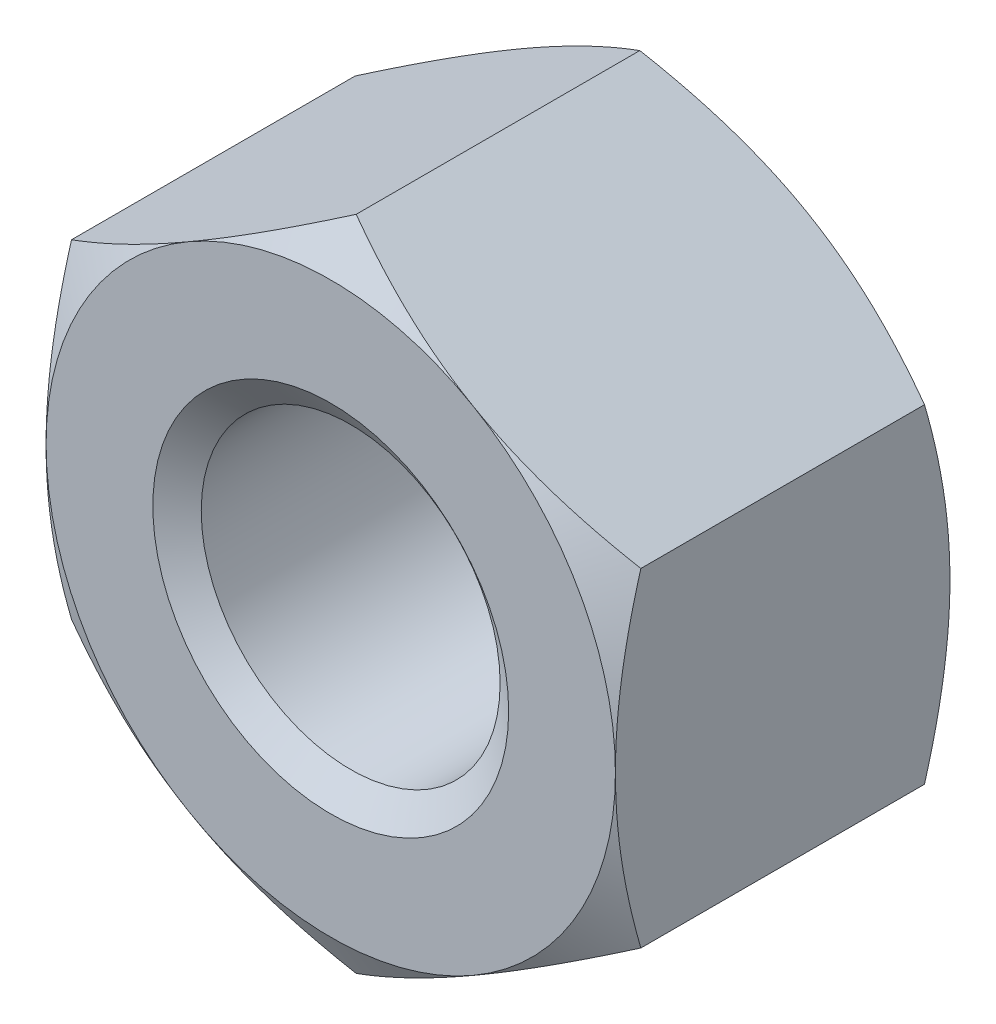
ISO-10303-21;
HEADER;
FILE_DESCRIPTION(('STEP AP214'),'2;1');
FILE_NAME('part.step','',(''),(''),'','','');
FILE_SCHEMA(('AUTOMOTIVE_DESIGN { 1 0 10303 214 1 1 1 1 }'));
ENDSEC;
DATA;
#1=APPLICATION_CONTEXT('core data for automotive mechanical design processes');
#2=APPLICATION_PROTOCOL_DEFINITION('international standard','automotive_design',2000,#1);
#3=PRODUCT_CONTEXT('',#1,'mechanical');
#4=PRODUCT('Part','Part','',(#3));
#5=PRODUCT_RELATED_PRODUCT_CATEGORY('part','',(#4));
#6=PRODUCT_DEFINITION_FORMATION('','',#4);
#7=PRODUCT_DEFINITION_CONTEXT('part definition',#1,'design');
#8=PRODUCT_DEFINITION('design','',#6,#7);
#9=PRODUCT_DEFINITION_SHAPE('','',#8);
#10=(LENGTH_UNIT() NAMED_UNIT(*) SI_UNIT(.MILLI.,.METRE.));
#11=(NAMED_UNIT(*) PLANE_ANGLE_UNIT() SI_UNIT($,.RADIAN.));
#12=(NAMED_UNIT(*) SI_UNIT($,.STERADIAN.) SOLID_ANGLE_UNIT());
#13=UNCERTAINTY_MEASURE_WITH_UNIT(LENGTH_MEASURE(1.E-05),#10,'distance_accuracy_value','');
#14=(GEOMETRIC_REPRESENTATION_CONTEXT(3) GLOBAL_UNCERTAINTY_ASSIGNED_CONTEXT((#13)) GLOBAL_UNIT_ASSIGNED_CONTEXT((#10,
#11,#12)) REPRESENTATION_CONTEXT('',''));
#15=CARTESIAN_POINT('',(0.,0.,0.));
#16=DIRECTION('',(0.,0.,1.));
#17=DIRECTION('',(1.,0.,0.));
#18=AXIS2_PLACEMENT_3D('',#15,#16,#17);
#19=CARTESIAN_POINT('',(0.,0.,-4.7));
#20=DIRECTION('',(0.,0.,1.));
#21=DIRECTION('',(1.,0.,0.));
#22=AXIS2_PLACEMENT_3D('',#19,#20,#21);
#23=CYLINDRICAL_SURFACE('',#22,2.1);
#24=CARTESIAN_POINT('',(0.,0.,-0.28008301528388));
#25=DIRECTION('',(0.,0.,1.));
#26=DIRECTION('',(1.,0.,0.));
#27=AXIS2_PLACEMENT_3D('',#24,#25,#26);
#28=CIRCLE('',#27,2.1);
#29=CARTESIAN_POINT('',(2.1,0.,-0.28008301528388));
#30=VERTEX_POINT('',#29);
#31=EDGE_CURVE('E170',#30,#30,#28,.F.);
#32=ORIENTED_EDGE('',*,*,#31,.F.);
#33=EDGE_LOOP('',(#32));
#34=FACE_BOUND('',#33,.T.);
#35=CARTESIAN_POINT('',(0.,0.,-4.39451698471612));
#36=DIRECTION('',(0.,0.,-1.));
#37=DIRECTION('',(-1.,0.,0.));
#38=AXIS2_PLACEMENT_3D('',#35,#36,#37);
#39=CIRCLE('',#38,2.1);
#40=CARTESIAN_POINT('',(-2.1,0.,-4.39451698471612));
#41=VERTEX_POINT('',#40);
#42=EDGE_CURVE('E35',#41,#41,#39,.F.);
#43=ORIENTED_EDGE('',*,*,#42,.F.);
#44=EDGE_LOOP('',(#43));
#45=FACE_BOUND('',#44,.T.);
#46=ADVANCED_FACE('F30',(#34,#45),#23,.F.);
#47=CARTESIAN_POINT('',(0.,4.61880215351702,-4.7));
#48=DIRECTION('',(0.,0.,-1.));
#49=DIRECTION('',(-1.,0.,0.));
#50=AXIS2_PLACEMENT_3D('',#47,#48,#49);
#51=PLANE('',#50);
#52=CARTESIAN_POINT('',(0.,0.,-4.7));
#53=DIRECTION('',(0.,0.,-1.));
#54=DIRECTION('',(-1.,0.,0.));
#55=AXIS2_PLACEMENT_3D('',#52,#53,#54);
#56=CIRCLE('',#55,4.);
#57=CARTESIAN_POINT('',(-4.,0.,-4.7));
#58=VERTEX_POINT('',#57);
#59=CARTESIAN_POINT('',(-2.00000000000002,-3.46410161513774,-4.7));
#60=VERTEX_POINT('',#59);
#61=EDGE_CURVE('E166',#58,#60,#56,.F.);
#62=ORIENTED_EDGE('',*,*,#61,.F.);
#63=CARTESIAN_POINT('',(-2.00000000000001,3.46410161513775,-4.7));
#64=VERTEX_POINT('',#63);
#65=EDGE_CURVE('E148',#64,#58,#56,.F.);
#66=ORIENTED_EDGE('',*,*,#65,.F.);
#67=CARTESIAN_POINT('',(2.00000000000003,3.46410161513774,-4.7));
#68=VERTEX_POINT('',#67);
#69=EDGE_CURVE('E165',#68,#64,#56,.F.);
#70=ORIENTED_EDGE('',*,*,#69,.F.);
#71=CARTESIAN_POINT('',(0.,0.,-4.7));
#72=DIRECTION('',(0.,0.,1.));
#73=DIRECTION('',(1.,0.,0.));
#74=AXIS2_PLACEMENT_3D('',#71,#72,#73);
#75=CIRCLE('',#74,4.);
#76=CARTESIAN_POINT('',(4.,0.,-4.7));
#77=VERTEX_POINT('',#76);
#78=EDGE_CURVE('E240',#77,#68,#75,.T.);
#79=ORIENTED_EDGE('',*,*,#78,.F.);
#80=CARTESIAN_POINT('',(2.00000000000001,-3.46410161513775,-4.7));
#81=VERTEX_POINT('',#80);
#82=EDGE_CURVE('E356',#81,#77,#56,.F.);
#83=ORIENTED_EDGE('',*,*,#82,.F.);
#84=EDGE_CURVE('E360',#60,#81,#56,.F.);
#85=ORIENTED_EDGE('',*,*,#84,.F.);
#86=EDGE_LOOP('',(#62,#66,#70,#79,#83,#85));
#87=FACE_BOUND('',#86,.T.);
#88=CARTESIAN_POINT('',(0.,0.,-4.7));
#89=DIRECTION('',(0.,0.,-1.));
#90=DIRECTION('',(-1.,0.,0.));
#91=AXIS2_PLACEMENT_3D('',#88,#89,#90);
#92=CIRCLE('',#91,2.5);
#93=CARTESIAN_POINT('',(-2.5,0.,-4.7));
#94=VERTEX_POINT('',#93);
#95=EDGE_CURVE('E173',#94,#94,#92,.F.);
#96=ORIENTED_EDGE('',*,*,#95,.T.);
#97=EDGE_LOOP('',(#96));
#98=FACE_BOUND('',#97,.T.);
#99=ADVANCED_FACE('F293',(#87,#98),#51,.T.);
#100=CARTESIAN_POINT('',(0.,4.61880215351702,0.));
#101=DIRECTION('',(0.,0.,-1.));
#102=DIRECTION('',(-1.,0.,0.));
#103=AXIS2_PLACEMENT_3D('',#100,#101,#102);
#104=PLANE('',#103);
#105=CARTESIAN_POINT('',(0.,0.,0.));
#106=DIRECTION('',(0.,0.,-1.));
#107=DIRECTION('',(-1.,0.,0.));
#108=AXIS2_PLACEMENT_3D('',#105,#106,#107);
#109=CIRCLE('',#108,4.);
#110=CARTESIAN_POINT('',(-4.,0.,0.));
#111=VERTEX_POINT('',#110);
#112=CARTESIAN_POINT('',(-2.00000000000001,3.46410161513775,0.));
#113=VERTEX_POINT('',#112);
#114=EDGE_CURVE('E11',#111,#113,#109,.T.);
#115=ORIENTED_EDGE('',*,*,#114,.F.);
#116=CARTESIAN_POINT('',(-2.00000000000002,-3.46410161513774,0.));
#117=VERTEX_POINT('',#116);
#118=EDGE_CURVE('E42',#117,#111,#109,.T.);
#119=ORIENTED_EDGE('',*,*,#118,.F.);
#120=CARTESIAN_POINT('',(2.00000000000001,-3.46410161513775,0.));
#121=VERTEX_POINT('',#120);
#122=EDGE_CURVE('E169',#121,#117,#109,.T.);
#123=ORIENTED_EDGE('',*,*,#122,.F.);
#124=CARTESIAN_POINT('',(4.,0.,0.));
#125=VERTEX_POINT('',#124);
#126=EDGE_CURVE('E347',#125,#121,#109,.T.);
#127=ORIENTED_EDGE('',*,*,#126,.F.);
#128=CARTESIAN_POINT('',(0.,0.,0.));
#129=DIRECTION('',(0.,0.,1.));
#130=DIRECTION('',(1.,0.,0.));
#131=AXIS2_PLACEMENT_3D('',#128,#129,#130);
#132=CIRCLE('',#131,4.);
#133=CARTESIAN_POINT('',(2.00000000000003,3.46410161513774,0.));
#134=VERTEX_POINT('',#133);
#135=EDGE_CURVE('E124',#125,#134,#132,.T.);
#136=ORIENTED_EDGE('',*,*,#135,.T.);
#137=EDGE_CURVE('E40',#113,#134,#109,.T.);
#138=ORIENTED_EDGE('',*,*,#137,.F.);
#139=EDGE_LOOP('',(#115,#119,#123,#127,#136,#138));
#140=FACE_BOUND('',#139,.T.);
#141=CARTESIAN_POINT('',(0.,0.,0.));
#142=DIRECTION('',(0.,0.,1.));
#143=DIRECTION('',(1.,0.,0.));
#144=AXIS2_PLACEMENT_3D('',#141,#142,#143);
#145=CIRCLE('',#144,2.5);
#146=CARTESIAN_POINT('',(2.5,0.,0.));
#147=VERTEX_POINT('',#146);
#148=EDGE_CURVE('E172',#147,#147,#145,.T.);
#149=ORIENTED_EDGE('',*,*,#148,.F.);
#150=EDGE_LOOP('',(#149));
#151=FACE_BOUND('',#150,.T.);
#152=ADVANCED_FACE('F245',(#140,#151),#104,.F.);
#153=CARTESIAN_POINT('',(0.,4.61880215351702,-4.7));
#154=DIRECTION('',(-0.500000000000002,0.866025403784437,0.));
#155=DIRECTION('',(-0.866025403784437,-0.500000000000002,0.));
#156=AXIS2_PLACEMENT_3D('',#153,#154,#155);
#157=PLANE('',#156);
#158=DIRECTION('',(0.,0.,1.));
#159=VECTOR('',#158,1.);
#160=CARTESIAN_POINT('',(-4.,2.3094010767585,-4.7));
#161=LINE('',#160,#159);
#162=CARTESIAN_POINT('',(-4.,2.30940107675853,-4.34273441009183));
#163=VERTEX_POINT('',#162);
#164=CARTESIAN_POINT('',(-4.,2.3094010767585,-0.357265589908163));
#165=VERTEX_POINT('',#164);
#166=EDGE_CURVE('E160',#163,#165,#161,.T.);
#167=ORIENTED_EDGE('',*,*,#166,.T.);
#168=CARTESIAN_POINT('',(-4.0002,2.30928560670466,-0.357332259074767));
#169=CARTESIAN_POINT('',(-3.82442084967677,2.4107717464617,-0.298717873648283));
#170=CARTESIAN_POINT('',(-3.64712438367362,2.51313390883499,-0.245410321462263));
#171=CARTESIAN_POINT('',(-3.28946140682429,2.71963072479811,-0.152361670746403));
#172=CARTESIAN_POINT('',(-3.10908854102985,2.82376904741904,-0.112653489029704));
#173=CARTESIAN_POINT('',(-2.75057818129721,3.03075510011795,-0.0508422152802782));
#174=CARTESIAN_POINT('',(-2.57249584706486,3.13357098372491,-0.0283277315228877));
#175=CARTESIAN_POINT('',(-2.21549328283349,3.33968651028528,-0.00145062314658093));
#176=CARTESIAN_POINT('',(-2.0365743503559,3.44298540411434,0.002934258573057));
#177=CARTESIAN_POINT('',(-1.70225715780327,3.63600352522932,-0.00619007293997066));
#178=CARTESIAN_POINT('',(-1.54680884001293,3.72575165335065,-0.0174589539879948));
#179=CARTESIAN_POINT('',(-1.23692494436494,3.90466320392055,-0.0531739907981949));
#180=CARTESIAN_POINT('',(-1.08249043825587,3.99382600759479,-0.0776323457115357));
#181=CARTESIAN_POINT('',(-0.771967672225416,4.17310641015198,-0.138776064919294));
#182=CARTESIAN_POINT('',(-0.615918711936891,4.26320131938132,-0.175720603654869));
#183=CARTESIAN_POINT('',(-0.306148164596151,4.44204742827552,-0.259570072548035));
#184=CARTESIAN_POINT('',(-0.15242260922621,4.53080091904968,-0.306455302212749));
#185=CARTESIAN_POINT('',(0.000200000000011548,4.61891762357086,-0.357332259074777));
#186=B_SPLINE_CURVE_WITH_KNOTS('',3,(#168,#169,#170,#171,#172,#173,#174,#175,#176,#177,#178,
#179,#180,#181,#182,#183,#184,#185),.UNSPECIFIED.,.F.,.F.,(4,2,2,2,2,2,2,2,4),(0.,
0.634047835695966,1.26961969224543,1.88946157213122,2.50854226669297,3.04757825393386,
3.58711366126905,4.13861653143765,4.68903648037745),.UNSPECIFIED.);
#187=EDGE_CURVE('E129',#165,#113,#186,.T.);
#188=ORIENTED_EDGE('',*,*,#187,.T.);
#189=CARTESIAN_POINT('',(0.,4.61880215351702,-0.357265589908173));
#190=VERTEX_POINT('',#189);
#191=EDGE_CURVE('E49',#113,#190,#186,.T.);
#192=ORIENTED_EDGE('',*,*,#191,.T.);
#193=DIRECTION('',(0.,0.,1.));
#194=VECTOR('',#193,1.);
#195=CARTESIAN_POINT('',(0.,4.61880215351702,-4.7));
#196=LINE('',#195,#194);
#197=CARTESIAN_POINT('',(0.,4.61880215351702,-4.34273441009183));
#198=VERTEX_POINT('',#197);
#199=EDGE_CURVE('E145',#198,#190,#196,.T.);
#200=ORIENTED_EDGE('',*,*,#199,.F.);
#201=CARTESIAN_POINT('',(-4.0002,2.30928560670466,-4.34266774092523));
#202=CARTESIAN_POINT('',(-3.82442084967677,2.4107717464617,-4.40128212635172));
#203=CARTESIAN_POINT('',(-3.64712438367362,2.51313390883499,-4.45458967853774));
#204=CARTESIAN_POINT('',(-3.28946140682429,2.71963072479811,-4.5476383292536));
#205=CARTESIAN_POINT('',(-3.10908854102985,2.82376904741904,-4.5873465109703));
#206=CARTESIAN_POINT('',(-2.75057818129721,3.03075510011795,-4.64915778471972));
#207=CARTESIAN_POINT('',(-2.57249584706486,3.13357098372491,-4.67167226847711));
#208=CARTESIAN_POINT('',(-2.21549328283349,3.33968651028528,-4.69854937685342));
#209=CARTESIAN_POINT('',(-2.0365743503559,3.44298540411434,-4.70293425857306));
#210=CARTESIAN_POINT('',(-1.70225715780327,3.63600352522932,-4.69380992706003));
#211=CARTESIAN_POINT('',(-1.54680884001293,3.72575165335065,-4.682541046012));
#212=CARTESIAN_POINT('',(-1.23692494436494,3.90466320392055,-4.6468260092018));
#213=CARTESIAN_POINT('',(-1.08249043825587,3.99382600759479,-4.62236765428846));
#214=CARTESIAN_POINT('',(-0.771967672225415,4.17310641015198,-4.56122393508071));
#215=CARTESIAN_POINT('',(-0.61591871193689,4.26320131938132,-4.52427939634513));
#216=CARTESIAN_POINT('',(-0.306148164596151,4.44204742827552,-4.44042992745196));
#217=CARTESIAN_POINT('',(-0.15242260922621,4.53080091904968,-4.39354469778725));
#218=CARTESIAN_POINT('',(0.000200000000011667,4.61891762357086,-4.34266774092522));
#219=B_SPLINE_CURVE_WITH_KNOTS('',3,(#201,#202,#203,#204,#205,#206,#207,#208,#209,#210,#211,
#212,#213,#214,#215,#216,#217,#218),.UNSPECIFIED.,.F.,.F.,(4,2,2,2,2,2,2,2,4),(0.,
0.634047835695966,1.26961969224543,1.88946157213122,2.50854226669297,3.04757825393386,
3.58711366126905,4.13861653143765,4.68903648037745),.UNSPECIFIED.);
#220=EDGE_CURVE('E163',#64,#198,#219,.T.);
#221=ORIENTED_EDGE('',*,*,#220,.F.);
#222=EDGE_CURVE('E255',#163,#64,#219,.T.);
#223=ORIENTED_EDGE('',*,*,#222,.F.);
#224=EDGE_LOOP('',(#167,#188,#192,#200,#221,#223));
#225=FACE_BOUND('',#224,.T.);
#226=ADVANCED_FACE('F32',(#225),#157,.T.);
#227=CARTESIAN_POINT('',(4.,2.30940107675848,-4.7));
#228=DIRECTION('',(0.500000000000007,0.866025403784435,0.));
#229=DIRECTION('',(-0.866025403784435,0.500000000000007,0.));
#230=AXIS2_PLACEMENT_3D('',#227,#228,#229);
#231=PLANE('',#230);
#232=ORIENTED_EDGE('',*,*,#199,.T.);
#233=CARTESIAN_POINT('',(-0.000199999999988241,4.61891762357086,-0.357332259074777));
#234=CARTESIAN_POINT('',(0.17557915032324,4.51743148381382,-0.298717873648292));
#235=CARTESIAN_POINT('',(0.352875616326392,4.41506932144053,-0.245410321462271));
#236=CARTESIAN_POINT('',(0.710538593175718,4.2085725054774,-0.15236167074641));
#237=CARTESIAN_POINT('',(0.890911458970162,4.10443418285647,-0.112653489029709));
#238=CARTESIAN_POINT('',(1.2494218187028,3.89744813015756,-0.0508422152802823));
#239=CARTESIAN_POINT('',(1.42750415293515,3.79463224655059,-0.028327731522891));
#240=CARTESIAN_POINT('',(1.78450671716652,3.58851671999022,-0.00145062314658234));
#241=CARTESIAN_POINT('',(1.96342564964411,3.48521782616116,0.00293425857305684));
#242=CARTESIAN_POINT('',(2.29774284219674,3.29219970504618,-0.00619007293996906));
#243=CARTESIAN_POINT('',(2.45319115998708,3.20245157692485,-0.0174589539879925));
#244=CARTESIAN_POINT('',(2.76307505563506,3.02354002635495,-0.0531739907981907));
#245=CARTESIAN_POINT('',(2.91750956174414,2.93437722268071,-0.0776323457115305));
#246=CARTESIAN_POINT('',(3.22803232777459,2.75509682012352,-0.138776064919287));
#247=CARTESIAN_POINT('',(3.38408128806311,2.66500191089418,-0.175720603654861));
#248=CARTESIAN_POINT('',(3.69385183540384,2.48615580199999,-0.259570072548025));
#249=CARTESIAN_POINT('',(3.84757739077378,2.39740231122583,-0.306455302212738));
#250=CARTESIAN_POINT('',(4.0002,2.30928560670464,-0.357332259074764));
#251=B_SPLINE_CURVE_WITH_KNOTS('',3,(#233,#234,#235,#236,#237,#238,#239,#240,#241,#242,#243,
#244,#245,#246,#247,#248,#249,#250),.UNSPECIFIED.,.F.,.F.,(4,2,2,2,2,2,2,2,4),(0.,
0.634047835695969,1.26961969224544,1.88946157213123,2.50854226669298,3.04757825393387,
3.58711366126905,4.13861653143765,4.68903648037744),.UNSPECIFIED.);
#252=EDGE_CURVE('E139',#190,#134,#251,.T.);
#253=ORIENTED_EDGE('',*,*,#252,.T.);
#254=CARTESIAN_POINT('',(4.,2.30940107675852,-0.357265589908173));
#255=VERTEX_POINT('',#254);
#256=EDGE_CURVE('E56',#134,#255,#251,.T.);
#257=ORIENTED_EDGE('',*,*,#256,.T.);
#258=DIRECTION('',(0.,0.,1.));
#259=VECTOR('',#258,1.);
#260=CARTESIAN_POINT('',(4.,2.30940107675848,-4.7));
#261=LINE('',#260,#259);
#262=CARTESIAN_POINT('',(4.,2.30940107675852,-4.34273441009183));
#263=VERTEX_POINT('',#262);
#264=EDGE_CURVE('E138',#263,#255,#261,.T.);
#265=ORIENTED_EDGE('',*,*,#264,.F.);
#266=CARTESIAN_POINT('',(-0.00019999999998845,4.61891762357086,-4.34266774092522));
#267=CARTESIAN_POINT('',(0.175579150323239,4.51743148381382,-4.40128212635171));
#268=CARTESIAN_POINT('',(0.352875616326392,4.41506932144053,-4.45458967853773));
#269=CARTESIAN_POINT('',(0.710538593175717,4.2085725054774,-4.54763832925359));
#270=CARTESIAN_POINT('',(0.890911458970162,4.10443418285647,-4.58734651097029));
#271=CARTESIAN_POINT('',(1.2494218187028,3.89744813015756,-4.64915778471972));
#272=CARTESIAN_POINT('',(1.42750415293515,3.79463224655059,-4.67167226847711));
#273=CARTESIAN_POINT('',(1.78450671716652,3.58851671999022,-4.69854937685342));
#274=CARTESIAN_POINT('',(1.96342564964411,3.48521782616116,-4.70293425857306));
#275=CARTESIAN_POINT('',(2.29774284219674,3.29219970504618,-4.69380992706003));
#276=CARTESIAN_POINT('',(2.45319115998707,3.20245157692485,-4.68254104601201));
#277=CARTESIAN_POINT('',(2.76307505563506,3.02354002635495,-4.64682600920181));
#278=CARTESIAN_POINT('',(2.91750956174414,2.93437722268071,-4.62236765428847));
#279=CARTESIAN_POINT('',(3.22803232777458,2.75509682012352,-4.56122393508071));
#280=CARTESIAN_POINT('',(3.38408128806311,2.66500191089418,-4.52427939634514));
#281=CARTESIAN_POINT('',(3.69385183540384,2.48615580199999,-4.44042992745197));
#282=CARTESIAN_POINT('',(3.84757739077378,2.39740231122583,-4.39354469778726));
#283=CARTESIAN_POINT('',(4.0002,2.30928560670464,-4.34266774092523));
#284=B_SPLINE_CURVE_WITH_KNOTS('',3,(#266,#267,#268,#269,#270,#271,#272,#273,#274,#275,#276,
#277,#278,#279,#280,#281,#282,#283),.UNSPECIFIED.,.F.,.F.,(4,2,2,2,2,2,2,2,4),(0.,
0.634047835695968,1.26961969224544,1.88946157213123,2.50854226669298,3.04757825393387,
3.58711366126904,4.13861653143765,4.68903648037744),.UNSPECIFIED.);
#285=EDGE_CURVE('E249',#68,#263,#284,.T.);
#286=ORIENTED_EDGE('',*,*,#285,.F.);
#287=EDGE_CURVE('E254',#198,#68,#284,.T.);
#288=ORIENTED_EDGE('',*,*,#287,.F.);
#289=EDGE_LOOP('',(#232,#253,#257,#265,#286,#288));
#290=FACE_BOUND('',#289,.T.);
#291=ADVANCED_FACE('F136',(#290),#231,.T.);
#292=CARTESIAN_POINT('',(4.,2.30940107675848,-4.7));
#293=DIRECTION('',(-1.,0.,0.));
#294=DIRECTION('',(0.,0.,1.));
#295=AXIS2_PLACEMENT_3D('',#292,#293,#294);
#296=PLANE('',#295);
#297=CARTESIAN_POINT('',(4.,-6.12487198995896,-1.91410682124067));
#298=CARTESIAN_POINT('',(4.,-5.9492493703868,-1.82923627076692));
#299=CARTESIAN_POINT('',(4.,-5.7732115209529,-1.74520940380742));
#300=CARTESIAN_POINT('',(4.,-5.42008084777958,-1.57932514679719));
#301=CARTESIAN_POINT('',(4.,-5.24298784779931,-1.49746813236725));
#302=CARTESIAN_POINT('',(4.,-4.88656571686338,-1.33597446305858));
#303=CARTESIAN_POINT('',(4.,-4.70722958889366,-1.25635319506306));
#304=CARTESIAN_POINT('',(4.,-4.34708334747267,-1.10053058542032));
#305=CARTESIAN_POINT('',(4.,-4.16627331143541,-1.02432906550804));
#306=CARTESIAN_POINT('',(4.,-3.80064706744981,-0.875350650394381));
#307=CARTESIAN_POINT('',(4.,-3.61580892822773,-0.802627284215863));
#308=CARTESIAN_POINT('',(4.,-3.24395246794972,-0.662876230959436));
#309=CARTESIAN_POINT('',(4.,-3.05693390695805,-0.59584917756652));
#310=CARTESIAN_POINT('',(4.,-2.68080318253774,-0.469291748430896));
#311=CARTESIAN_POINT('',(4.,-2.49169643712852,-0.409745434783851));
#312=CARTESIAN_POINT('',(4.,-2.11079454635854,-0.300083356544518));
#313=CARTESIAN_POINT('',(4.,-1.91900027185752,-0.249964609676762));
#314=CARTESIAN_POINT('',(4.,-1.53259232698203,-0.16159079495405));
#315=CARTESIAN_POINT('',(4.,-1.33797792031653,-0.123338885956548));
#316=CARTESIAN_POINT('',(4.,-0.946402725872582,-0.0612742359223494));
#317=CARTESIAN_POINT('',(4.,-0.749441936019801,-0.0374615076517037));
#318=CARTESIAN_POINT('',(4.,-0.355451989627968,-0.00638181314943936));
#319=CARTESIAN_POINT('',(4.,-0.158431311094036,0.000989900761038723));
#320=CARTESIAN_POINT('',(4.,0.235472085607446,-0.00120406637479726));
#321=CARTESIAN_POINT('',(4.,0.432354826312183,-0.0107653508153518));
#322=CARTESIAN_POINT('',(4.,0.768560635225494,-0.040878734613591));
#323=CARTESIAN_POINT('',(4.,0.908254618381796,-0.0575092960439096));
#324=CARTESIAN_POINT('',(4.,1.18656349063495,-0.0982134103466906));
#325=CARTESIAN_POINT('',(4.,1.32517820601011,-0.122288137058445));
#326=CARTESIAN_POINT('',(4.,1.73929045452966,-0.204415070950227));
#327=CARTESIAN_POINT('',(4.,2.01284690528719,-0.272348886425149));
#328=CARTESIAN_POINT('',(4.,2.4221825301452,-0.389516359317197));
#329=CARTESIAN_POINT('',(4.,2.56009536361535,-0.43171394181163));
#330=CARTESIAN_POINT('',(4.,2.834481591014,-0.520284580227754));
#331=CARTESIAN_POINT('',(4.,2.97095590623554,-0.566654756186904));
#332=CARTESIAN_POINT('',(4.,3.24189440516337,-0.662605699180277));
#333=CARTESIAN_POINT('',(4.,3.37636557946834,-0.712166925753491));
#334=CARTESIAN_POINT('',(4.,3.6442646115291,-0.814198353790692));
#335=CARTESIAN_POINT('',(4.,3.77769202239383,-0.866669730963359));
#336=CARTESIAN_POINT('',(4.,3.9106369898668,-0.920309006541781));
#337=B_SPLINE_CURVE_WITH_KNOTS('',3,(#297,#298,#299,#300,#301,#302,#303,#304,#305,#306,#307,
#308,#309,#310,#311,#312,#313,#314,#315,#316,#317,#318,#319,#320,#321,#322,#323,#324,#325,#326,
#327,#328,#329,#330,#331,#332,#333,#334,#335,#336),.UNSPECIFIED.,.F.,.F.,(4,2,2,2,2,2,2,2,2,2,2,
2,2,2,2,2,2,2,2,4),(0.,0.585171792532274,1.17044423059927,1.7590659464599,2.34765694284827,
2.94347400997484,3.5393572721069,4.13394864697602,4.72835161391473,5.32291267067847,
5.91747425310815,6.50823685854039,7.09884609659889,7.52068140825524,7.94258327130842,
8.78701491359831,9.2196528189769,9.65199437116298,10.0819024146297,10.5119854255247),.UNSPECIFIED.);
#338=CARTESIAN_POINT('',(3.99999999999999,-2.30940107675855,-0.357265589908173));
#339=VERTEX_POINT('',#338);
#340=EDGE_CURVE('E131',#339,#125,#337,.T.);
#341=ORIENTED_EDGE('',*,*,#340,.F.);
#342=DIRECTION('',(0.,0.,1.));
#343=VECTOR('',#342,1.);
#344=CARTESIAN_POINT('',(4.,-2.30940107675854,-4.7));
#345=LINE('',#344,#343);
#346=CARTESIAN_POINT('',(3.99999999999999,-2.30940107675855,-4.34273441009183));
#347=VERTEX_POINT('',#346);
#348=EDGE_CURVE('E146',#347,#339,#345,.T.);
#349=ORIENTED_EDGE('',*,*,#348,.F.);
#350=CARTESIAN_POINT('',(4.,-6.12487198995896,-2.78589317875933));
#351=CARTESIAN_POINT('',(4.,-5.9492493703868,-2.87076372923307));
#352=CARTESIAN_POINT('',(4.,-5.7732115209529,-2.95479059619258));
#353=CARTESIAN_POINT('',(4.,-5.42008084777958,-3.12067485320281));
#354=CARTESIAN_POINT('',(4.,-5.24298784779931,-3.20253186763274));
#355=CARTESIAN_POINT('',(4.,-4.88656571686338,-3.36402553694142));
#356=CARTESIAN_POINT('',(4.,-4.70722958889366,-3.44364680493694));
#357=CARTESIAN_POINT('',(4.,-4.34708334747267,-3.59946941457968));
#358=CARTESIAN_POINT('',(4.,-4.16627331143541,-3.67567093449196));
#359=CARTESIAN_POINT('',(4.,-3.80064706744981,-3.82464934960562));
#360=CARTESIAN_POINT('',(4.,-3.61580892822773,-3.89737271578414));
#361=CARTESIAN_POINT('',(4.,-3.24395246794972,-4.03712376904056));
#362=CARTESIAN_POINT('',(4.,-3.05693390695805,-4.10415082243348));
#363=CARTESIAN_POINT('',(4.,-2.68080318253774,-4.2307082515691));
#364=CARTESIAN_POINT('',(4.,-2.49169643712852,-4.29025456521615));
#365=CARTESIAN_POINT('',(4.,-2.11079454635854,-4.39991664345548));
#366=CARTESIAN_POINT('',(4.,-1.91900027185752,-4.45003539032324));
#367=CARTESIAN_POINT('',(4.,-1.53259232698203,-4.53840920504595));
#368=CARTESIAN_POINT('',(4.,-1.33797792031653,-4.57666111404345));
#369=CARTESIAN_POINT('',(4.,-0.946402725872582,-4.63872576407765));
#370=CARTESIAN_POINT('',(4.,-0.749441936019801,-4.6625384923483));
#371=CARTESIAN_POINT('',(4.,-0.355451989627969,-4.69361818685056));
#372=CARTESIAN_POINT('',(4.,-0.158431311094036,-4.70098990076104));
#373=CARTESIAN_POINT('',(4.,0.235472085607445,-4.6987959336252));
#374=CARTESIAN_POINT('',(4.,0.432354826312183,-4.68923464918465));
#375=CARTESIAN_POINT('',(4.,0.768560635225494,-4.65912126538641));
#376=CARTESIAN_POINT('',(4.,0.908254618381796,-4.64249070395609));
#377=CARTESIAN_POINT('',(4.,1.18656349063495,-4.60178658965331));
#378=CARTESIAN_POINT('',(4.,1.32517820601011,-4.57771186294155));
#379=CARTESIAN_POINT('',(4.,1.73929045452966,-4.49558492904977));
#380=CARTESIAN_POINT('',(4.,2.01284690528719,-4.42765111357485));
#381=CARTESIAN_POINT('',(4.,2.4221825301452,-4.3104836406828));
#382=CARTESIAN_POINT('',(4.,2.56009536361535,-4.26828605818837));
#383=CARTESIAN_POINT('',(4.,2.834481591014,-4.17971541977225));
#384=CARTESIAN_POINT('',(4.,2.97095590623554,-4.1333452438131));
#385=CARTESIAN_POINT('',(4.,3.24189440516337,-4.03739430081972));
#386=CARTESIAN_POINT('',(4.,3.37636557946834,-3.98783307424651));
#387=CARTESIAN_POINT('',(4.,3.6442646115291,-3.88580164620931));
#388=CARTESIAN_POINT('',(4.,3.77769202239383,-3.83333026903664));
#389=CARTESIAN_POINT('',(4.,3.9106369898668,-3.77969099345822));
#390=B_SPLINE_CURVE_WITH_KNOTS('',3,(#350,#351,#352,#353,#354,#355,#356,#357,#358,#359,#360,
#361,#362,#363,#364,#365,#366,#367,#368,#369,#370,#371,#372,#373,#374,#375,#376,#377,#378,#379,
#380,#381,#382,#383,#384,#385,#386,#387,#388,#389),.UNSPECIFIED.,.F.,.F.,(4,2,2,2,2,2,2,2,2,2,2,
2,2,2,2,2,2,2,2,4),(0.,0.585171792532274,1.17044423059927,1.7590659464599,2.34765694284827,
2.94347400997484,3.5393572721069,4.13394864697602,4.72835161391473,5.32291267067847,
5.91747425310815,6.50823685854039,7.09884609659889,7.52068140825524,7.94258327130842,
8.78701491359831,9.2196528189769,9.65199437116298,10.0819024146297,10.5119854255247),.UNSPECIFIED.);
#391=EDGE_CURVE('E261',#347,#77,#390,.T.);
#392=ORIENTED_EDGE('',*,*,#391,.T.);
#393=EDGE_CURVE('E144',#77,#263,#390,.T.);
#394=ORIENTED_EDGE('',*,*,#393,.T.);
#395=ORIENTED_EDGE('',*,*,#264,.T.);
#396=EDGE_CURVE('E121',#125,#255,#337,.T.);
#397=ORIENTED_EDGE('',*,*,#396,.F.);
#398=EDGE_LOOP('',(#341,#349,#392,#394,#395,#397));
#399=FACE_BOUND('',#398,.T.);
#400=ADVANCED_FACE('F142',(#399),#296,.F.);
#401=CARTESIAN_POINT('',(0.,-4.61880215351706,-4.7));
#402=DIRECTION('',(0.500000000000003,-0.866025403784437,0.));
#403=DIRECTION('',(0.866025403784437,0.500000000000003,0.));
#404=AXIS2_PLACEMENT_3D('',#401,#402,#403);
#405=PLANE('',#404);
#406=ORIENTED_EDGE('',*,*,#348,.T.);
#407=CARTESIAN_POINT('',(4.0002,-2.3092856067047,-0.357332259074782));
#408=CARTESIAN_POINT('',(3.82442084967677,-2.41077174646174,-0.298717873648298));
#409=CARTESIAN_POINT('',(3.64712438367362,-2.51313390883503,-0.245410321462278));
#410=CARTESIAN_POINT('',(3.28946140682429,-2.71963072479816,-0.15236167074642));
#411=CARTESIAN_POINT('',(3.10908854102985,-2.82376904741909,-0.112653489029721));
#412=CARTESIAN_POINT('',(2.75057818129721,-3.030755100118,-0.0508422152802972));
#413=CARTESIAN_POINT('',(2.57249584706485,-3.13357098372496,-0.028327731522908));
#414=CARTESIAN_POINT('',(2.21549328283349,-3.33968651028533,-0.00145062314660318));
#415=CARTESIAN_POINT('',(2.03657435035589,-3.44298540411439,0.00293425857303419));
#416=CARTESIAN_POINT('',(1.70225715780326,-3.63600352522937,-0.00619007293999522));
#417=CARTESIAN_POINT('',(1.54680884001293,-3.7257516533507,-0.0174589539880202));
#418=CARTESIAN_POINT('',(1.23692494436494,-3.9046632039206,-0.053173990798221));
#419=CARTESIAN_POINT('',(1.08249043825586,-3.99382600759484,-0.0776323457115618));
#420=CARTESIAN_POINT('',(0.771967672225417,-4.17310641015202,-0.13877606491932));
#421=CARTESIAN_POINT('',(0.615918711936894,-4.26320131938137,-0.175720603654895));
#422=CARTESIAN_POINT('',(0.306148164596158,-4.44204742827556,-0.25957007254806));
#423=CARTESIAN_POINT('',(0.152422609226218,-4.53080091904972,-0.306455302212774));
#424=CARTESIAN_POINT('',(-0.000200000000002297,-4.6189176235709,-0.357332259074801));
#425=B_SPLINE_CURVE_WITH_KNOTS('',3,(#407,#408,#409,#410,#411,#412,#413,#414,#415,#416,#417,
#418,#419,#420,#421,#422,#423,#424),.UNSPECIFIED.,.F.,.F.,(4,2,2,2,2,2,2,2,4),(0.,
0.63404783569597,1.26961969224544,1.88946157213123,2.50854226669299,3.04757825393387,
3.58711366126905,4.13861653143765,4.68903648037745),.UNSPECIFIED.);
#426=EDGE_CURVE('E342',#339,#121,#425,.T.);
#427=ORIENTED_EDGE('',*,*,#426,.T.);
#428=CARTESIAN_POINT('',(0.,-4.61880215351702,-0.357265589908173));
#429=VERTEX_POINT('',#428);
#430=EDGE_CURVE('E221',#121,#429,#425,.T.);
#431=ORIENTED_EDGE('',*,*,#430,.T.);
#432=DIRECTION('',(0.,0.,1.));
#433=VECTOR('',#432,1.);
#434=CARTESIAN_POINT('',(0.,-4.61880215351706,-4.7));
#435=LINE('',#434,#433);
#436=CARTESIAN_POINT('',(0.,-4.61880215351702,-4.34273441009183));
#437=VERTEX_POINT('',#436);
#438=EDGE_CURVE('E151',#437,#429,#435,.T.);
#439=ORIENTED_EDGE('',*,*,#438,.F.);
#440=CARTESIAN_POINT('',(4.0002,-2.3092856067047,-4.34266774092522));
#441=CARTESIAN_POINT('',(3.82442084967677,-2.41077174646174,-4.4012821263517));
#442=CARTESIAN_POINT('',(3.64712438367362,-2.51313390883503,-4.45458967853772));
#443=CARTESIAN_POINT('',(3.28946140682429,-2.71963072479816,-4.54763832925358));
#444=CARTESIAN_POINT('',(3.10908854102985,-2.82376904741909,-4.58734651097028));
#445=CARTESIAN_POINT('',(2.75057818129721,-3.030755100118,-4.6491577847197));
#446=CARTESIAN_POINT('',(2.57249584706485,-3.13357098372496,-4.67167226847709));
#447=CARTESIAN_POINT('',(2.21549328283349,-3.33968651028533,-4.6985493768534));
#448=CARTESIAN_POINT('',(2.03657435035589,-3.44298540411439,-4.70293425857303));
#449=CARTESIAN_POINT('',(1.70225715780326,-3.63600352522937,-4.69380992706));
#450=CARTESIAN_POINT('',(1.54680884001293,-3.7257516533507,-4.68254104601198));
#451=CARTESIAN_POINT('',(1.23692494436494,-3.9046632039206,-4.64682600920178));
#452=CARTESIAN_POINT('',(1.08249043825586,-3.99382600759484,-4.62236765428844));
#453=CARTESIAN_POINT('',(0.771967672225418,-4.17310641015202,-4.56122393508068));
#454=CARTESIAN_POINT('',(0.615918711936894,-4.26320131938136,-4.5242793963451));
#455=CARTESIAN_POINT('',(0.306148164596157,-4.44204742827556,-4.44042992745194));
#456=CARTESIAN_POINT('',(0.152422609226217,-4.53080091904972,-4.39354469778723));
#457=CARTESIAN_POINT('',(-0.000200000000002174,-4.6189176235709,-4.3426677409252));
#458=B_SPLINE_CURVE_WITH_KNOTS('',3,(#440,#441,#442,#443,#444,#445,#446,#447,#448,#449,#450,
#451,#452,#453,#454,#455,#456,#457),.UNSPECIFIED.,.F.,.F.,(4,2,2,2,2,2,2,2,4),(0.,
0.63404783569597,1.26961969224544,1.88946157213123,2.50854226669299,3.04757825393387,
3.58711366126905,4.13861653143765,4.68903648037745),.UNSPECIFIED.);
#459=EDGE_CURVE('E267',#81,#437,#458,.T.);
#460=ORIENTED_EDGE('',*,*,#459,.F.);
#461=EDGE_CURVE('E266',#347,#81,#458,.T.);
#462=ORIENTED_EDGE('',*,*,#461,.F.);
#463=EDGE_LOOP('',(#406,#427,#431,#439,#460,#462));
#464=FACE_BOUND('',#463,.T.);
#465=ADVANCED_FACE('F277',(#464),#405,.T.);
#466=CARTESIAN_POINT('',(-4.,-2.30940107675853,-4.7));
#467=DIRECTION('',(-0.500000000000006,-0.866025403784435,0.));
#468=DIRECTION('',(0.866025403784436,-0.500000000000006,0.));
#469=AXIS2_PLACEMENT_3D('',#466,#467,#468);
#470=PLANE('',#469);
#471=ORIENTED_EDGE('',*,*,#438,.T.);
#472=CARTESIAN_POINT('',(0.000199999999997729,-4.6189176235709,-0.357332259074802));
#473=CARTESIAN_POINT('',(-0.175579150323232,-4.51743148381386,-0.298717873648315));
#474=CARTESIAN_POINT('',(-0.352875616326386,-4.41506932144057,-0.245410321462294));
#475=CARTESIAN_POINT('',(-0.710538593175715,-4.20857250547744,-0.152361670746431));
#476=CARTESIAN_POINT('',(-0.890911458970161,-4.10443418285651,-0.112653489029731));
#477=CARTESIAN_POINT('',(-1.2494218187028,-3.8974481301576,-0.0508422152803029));
#478=CARTESIAN_POINT('',(-1.42750415293516,-3.79463224655063,-0.0283277315229116));
#479=CARTESIAN_POINT('',(-1.78450671716653,-3.58851671999026,-0.00145062314660233));
#480=CARTESIAN_POINT('',(-1.96342564964412,-3.4852178261612,0.00293425857303738));
#481=CARTESIAN_POINT('',(-2.29774284219675,-3.29219970504621,-0.00619007293998834));
#482=CARTESIAN_POINT('',(-2.45319115998708,-3.20245157692489,-0.0174589539880117));
#483=CARTESIAN_POINT('',(-2.76307505563507,-3.02354002635499,-0.0531739907982092));
#484=CARTESIAN_POINT('',(-2.91750956174414,-2.93437722268075,-0.0776323457115483));
#485=CARTESIAN_POINT('',(-3.22803232777459,-2.75509682012356,-0.138776064919303));
#486=CARTESIAN_POINT('',(-3.38408128806311,-2.66500191089422,-0.175720603654876));
#487=CARTESIAN_POINT('',(-3.69385183540384,-2.48615580200003,-0.259570072548038));
#488=CARTESIAN_POINT('',(-3.84757739077378,-2.39740231122587,-0.30645530221275));
#489=CARTESIAN_POINT('',(-4.0002,-2.30928560670469,-0.357332259074776));
#490=B_SPLINE_CURVE_WITH_KNOTS('',3,(#472,#473,#474,#475,#476,#477,#478,#479,#480,#481,#482,
#483,#484,#485,#486,#487,#488,#489),.UNSPECIFIED.,.F.,.F.,(4,2,2,2,2,2,2,2,4),(0.,
0.634047835695975,1.26961969224545,1.88946157213125,2.508542266693,3.04757825393389,
3.58711366126906,4.13861653143766,4.68903648037745),.UNSPECIFIED.);
#491=EDGE_CURVE('E340',#429,#117,#490,.T.);
#492=ORIENTED_EDGE('',*,*,#491,.T.);
#493=CARTESIAN_POINT('',(-4.,-2.30940107675853,-0.357265589908173));
#494=VERTEX_POINT('',#493);
#495=EDGE_CURVE('E195',#117,#494,#490,.T.);
#496=ORIENTED_EDGE('',*,*,#495,.T.);
#497=DIRECTION('',(0.,0.,1.));
#498=VECTOR('',#497,1.);
#499=CARTESIAN_POINT('',(-4.,-2.30940107675853,-4.7));
#500=LINE('',#499,#498);
#501=CARTESIAN_POINT('',(-4.,-2.30940107675853,-4.34273441009183));
#502=VERTEX_POINT('',#501);
#503=EDGE_CURVE('E157',#502,#494,#500,.T.);
#504=ORIENTED_EDGE('',*,*,#503,.F.);
#505=CARTESIAN_POINT('',(0.000199999999997729,-4.6189176235709,-4.3426677409252));
#506=CARTESIAN_POINT('',(-0.175579150323232,-4.51743148381386,-4.40128212635168));
#507=CARTESIAN_POINT('',(-0.352875616326386,-4.41506932144057,-4.45458967853771));
#508=CARTESIAN_POINT('',(-0.710538593175715,-4.20857250547744,-4.54763832925357));
#509=CARTESIAN_POINT('',(-0.890911458970161,-4.10443418285651,-4.58734651097027));
#510=CARTESIAN_POINT('',(-1.2494218187028,-3.8974481301576,-4.6491577847197));
#511=CARTESIAN_POINT('',(-1.42750415293516,-3.79463224655063,-4.67167226847709));
#512=CARTESIAN_POINT('',(-1.78450671716653,-3.58851671999026,-4.6985493768534));
#513=CARTESIAN_POINT('',(-1.96342564964412,-3.4852178261612,-4.70293425857304));
#514=CARTESIAN_POINT('',(-2.29774284219675,-3.29219970504621,-4.69380992706001));
#515=CARTESIAN_POINT('',(-2.45319115998708,-3.20245157692489,-4.68254104601199));
#516=CARTESIAN_POINT('',(-2.76307505563507,-3.02354002635499,-4.64682600920179));
#517=CARTESIAN_POINT('',(-2.91750956174414,-2.93437722268075,-4.62236765428845));
#518=CARTESIAN_POINT('',(-3.22803232777459,-2.75509682012356,-4.5612239350807));
#519=CARTESIAN_POINT('',(-3.38408128806311,-2.66500191089422,-4.52427939634512));
#520=CARTESIAN_POINT('',(-3.69385183540384,-2.48615580200003,-4.44042992745196));
#521=CARTESIAN_POINT('',(-3.84757739077378,-2.39740231122587,-4.39354469778725));
#522=CARTESIAN_POINT('',(-4.0002,-2.30928560670469,-4.34266774092522));
#523=B_SPLINE_CURVE_WITH_KNOTS('',3,(#505,#506,#507,#508,#509,#510,#511,#512,#513,#514,#515,
#516,#517,#518,#519,#520,#521,#522),.UNSPECIFIED.,.F.,.F.,(4,2,2,2,2,2,2,2,4),(0.,
0.634047835695975,1.26961969224545,1.88946157213125,2.508542266693,3.04757825393389,
3.58711366126906,4.13861653143766,4.68903648037745),.UNSPECIFIED.);
#524=EDGE_CURVE('E273',#60,#502,#523,.T.);
#525=ORIENTED_EDGE('',*,*,#524,.F.);
#526=EDGE_CURVE('E272',#437,#60,#523,.T.);
#527=ORIENTED_EDGE('',*,*,#526,.F.);
#528=EDGE_LOOP('',(#471,#492,#496,#504,#525,#527));
#529=FACE_BOUND('',#528,.T.);
#530=ADVANCED_FACE('F280',(#529),#470,.T.);
#531=CARTESIAN_POINT('',(-4.,2.3094010767585,-4.7));
#532=DIRECTION('',(-1.,0.,0.));
#533=DIRECTION('',(0.,0.,1.));
#534=AXIS2_PLACEMENT_3D('',#531,#532,#533);
#535=PLANE('',#534);
#536=ORIENTED_EDGE('',*,*,#503,.T.);
#537=CARTESIAN_POINT('',(-4.,-6.12487198995894,-1.91410682124066));
#538=CARTESIAN_POINT('',(-4.,-5.94924937038678,-1.82923627076691));
#539=CARTESIAN_POINT('',(-4.,-5.77321152095288,-1.74520940380741));
#540=CARTESIAN_POINT('',(-4.,-5.42008084777957,-1.57932514679718));
#541=CARTESIAN_POINT('',(-4.,-5.2429878477993,-1.49746813236725));
#542=CARTESIAN_POINT('',(-4.,-4.88656571686336,-1.33597446305857));
#543=CARTESIAN_POINT('',(-4.,-4.70722958889364,-1.25635319506305));
#544=CARTESIAN_POINT('',(-4.,-4.34708334747265,-1.10053058542031));
#545=CARTESIAN_POINT('',(-4.,-4.1662733114354,-1.02432906550803));
#546=CARTESIAN_POINT('',(-4.,-3.8006470674498,-0.875350650394373));
#547=CARTESIAN_POINT('',(-4.,-3.61580892822772,-0.802627284215856));
#548=CARTESIAN_POINT('',(-4.,-3.2439524679497,-0.662876230959429));
#549=CARTESIAN_POINT('',(-4.,-3.05693390695803,-0.595849177566513));
#550=CARTESIAN_POINT('',(-4.,-2.68080318253773,-0.469291748430889));
#551=CARTESIAN_POINT('',(-4.,-2.4916964371285,-0.409745434783844));
#552=CARTESIAN_POINT('',(-4.,-2.11079454635853,-0.300083356544512));
#553=CARTESIAN_POINT('',(-4.,-1.91900027185751,-0.249964609676757));
#554=CARTESIAN_POINT('',(-4.,-1.53259232698202,-0.161590794954046));
#555=CARTESIAN_POINT('',(-4.,-1.33797792031651,-0.123338885956544));
#556=CARTESIAN_POINT('',(-4.,-0.94640272587257,-0.0612742359223458));
#557=CARTESIAN_POINT('',(-4.,-0.74944193601979,-0.0374615076517008));
#558=CARTESIAN_POINT('',(-4.,-0.355451989627958,-0.00638181314943726));
#559=CARTESIAN_POINT('',(-4.,-0.158431311094026,0.000989900761040813));
#560=CARTESIAN_POINT('',(-4.,0.235472085607455,-0.00120406637479534));
#561=CARTESIAN_POINT('',(-4.,0.432354826312192,-0.0107653508153501));
#562=CARTESIAN_POINT('',(-4.,0.768560635225503,-0.0408787346135896));
#563=CARTESIAN_POINT('',(-4.,0.908254618381805,-0.0575092960439084));
#564=CARTESIAN_POINT('',(-4.,1.18656349063496,-0.0982134103466897));
#565=CARTESIAN_POINT('',(-4.,1.32517820601012,-0.122288137058444));
#566=CARTESIAN_POINT('',(-4.,1.73929045452967,-0.204415070950227));
#567=CARTESIAN_POINT('',(-4.,2.0128469052872,-0.272348886425149));
#568=CARTESIAN_POINT('',(-4.,2.42218253014521,-0.389516359317198));
#569=CARTESIAN_POINT('',(-4.,2.56009536361536,-0.431713941811631));
#570=CARTESIAN_POINT('',(-4.,2.83448159101401,-0.520284580227756));
#571=CARTESIAN_POINT('',(-4.,2.97095590623555,-0.566654756186905));
#572=CARTESIAN_POINT('',(-4.,3.24189440516338,-0.662605699180279));
#573=CARTESIAN_POINT('',(-4.,3.37636557946835,-0.712166925753492));
#574=CARTESIAN_POINT('',(-4.,3.64426461152911,-0.814198353790694));
#575=CARTESIAN_POINT('',(-4.,3.77769202239384,-0.866669730963361));
#576=CARTESIAN_POINT('',(-4.,3.91063698986681,-0.920309006541784));
#577=B_SPLINE_CURVE_WITH_KNOTS('',3,(#537,#538,#539,#540,#541,#542,#543,#544,#545,#546,#547,
#548,#549,#550,#551,#552,#553,#554,#555,#556,#557,#558,#559,#560,#561,#562,#563,#564,#565,#566,
#567,#568,#569,#570,#571,#572,#573,#574,#575,#576),.UNSPECIFIED.,.F.,.F.,(4,2,2,2,2,2,2,2,2,2,2,
2,2,2,2,2,2,2,2,4),(0.,0.585171792532271,1.17044423059927,1.7590659464599,2.34765694284827,
2.94347400997484,3.53935727210689,4.13394864697601,4.72835161391472,5.32291267067846,
5.91747425310814,6.50823685854038,7.09884609659888,7.52068140825522,7.9425832713084,
8.7870149135983,9.21965281897689,9.65199437116297,10.0819024146297,10.5119854255247),.UNSPECIFIED.);
#578=EDGE_CURVE('E194',#494,#111,#577,.T.);
#579=ORIENTED_EDGE('',*,*,#578,.T.);
#580=EDGE_CURVE('E187',#111,#165,#577,.T.);
#581=ORIENTED_EDGE('',*,*,#580,.T.);
#582=ORIENTED_EDGE('',*,*,#166,.F.);
#583=CARTESIAN_POINT('',(-4.,-6.12487198995894,-2.78589317875934));
#584=CARTESIAN_POINT('',(-4.,-5.94924937038678,-2.87076372923308));
#585=CARTESIAN_POINT('',(-4.,-5.77321152095288,-2.95479059619259));
#586=CARTESIAN_POINT('',(-4.,-5.42008084777957,-3.12067485320282));
#587=CARTESIAN_POINT('',(-4.,-5.2429878477993,-3.20253186763275));
#588=CARTESIAN_POINT('',(-4.,-4.88656571686336,-3.36402553694143));
#589=CARTESIAN_POINT('',(-4.,-4.70722958889364,-3.44364680493695));
#590=CARTESIAN_POINT('',(-4.,-4.34708334747265,-3.59946941457969));
#591=CARTESIAN_POINT('',(-4.,-4.1662733114354,-3.67567093449197));
#592=CARTESIAN_POINT('',(-4.,-3.8006470674498,-3.82464934960563));
#593=CARTESIAN_POINT('',(-4.,-3.61580892822772,-3.89737271578414));
#594=CARTESIAN_POINT('',(-4.,-3.2439524679497,-4.03712376904057));
#595=CARTESIAN_POINT('',(-4.,-3.05693390695803,-4.10415082243349));
#596=CARTESIAN_POINT('',(-4.,-2.68080318253773,-4.23070825156911));
#597=CARTESIAN_POINT('',(-4.,-2.4916964371285,-4.29025456521615));
#598=CARTESIAN_POINT('',(-4.,-2.11079454635853,-4.39991664345549));
#599=CARTESIAN_POINT('',(-4.,-1.91900027185751,-4.45003539032324));
#600=CARTESIAN_POINT('',(-4.,-1.53259232698202,-4.53840920504595));
#601=CARTESIAN_POINT('',(-4.,-1.33797792031651,-4.57666111404346));
#602=CARTESIAN_POINT('',(-4.,-0.94640272587257,-4.63872576407765));
#603=CARTESIAN_POINT('',(-4.,-0.74944193601979,-4.6625384923483));
#604=CARTESIAN_POINT('',(-4.,-0.355451989627958,-4.69361818685056));
#605=CARTESIAN_POINT('',(-4.,-0.158431311094026,-4.70098990076104));
#606=CARTESIAN_POINT('',(-4.,0.235472085607455,-4.6987959336252));
#607=CARTESIAN_POINT('',(-4.,0.432354826312192,-4.68923464918465));
#608=CARTESIAN_POINT('',(-4.,0.768560635225503,-4.65912126538641));
#609=CARTESIAN_POINT('',(-4.,0.908254618381805,-4.64249070395609));
#610=CARTESIAN_POINT('',(-4.,1.18656349063496,-4.60178658965331));
#611=CARTESIAN_POINT('',(-4.,1.32517820601012,-4.57771186294155));
#612=CARTESIAN_POINT('',(-4.,1.73929045452967,-4.49558492904977));
#613=CARTESIAN_POINT('',(-4.,2.0128469052872,-4.42765111357485));
#614=CARTESIAN_POINT('',(-4.,2.42218253014521,-4.3104836406828));
#615=CARTESIAN_POINT('',(-4.,2.56009536361536,-4.26828605818837));
#616=CARTESIAN_POINT('',(-4.,2.83448159101401,-4.17971541977224));
#617=CARTESIAN_POINT('',(-4.,2.97095590623555,-4.13334524381309));
#618=CARTESIAN_POINT('',(-4.,3.24189440516338,-4.03739430081972));
#619=CARTESIAN_POINT('',(-4.,3.37636557946835,-3.98783307424651));
#620=CARTESIAN_POINT('',(-4.,3.64426461152911,-3.88580164620931));
#621=CARTESIAN_POINT('',(-4.,3.77769202239384,-3.83333026903664));
#622=CARTESIAN_POINT('',(-4.,3.91063698986681,-3.77969099345822));
#623=B_SPLINE_CURVE_WITH_KNOTS('',3,(#583,#584,#585,#586,#587,#588,#589,#590,#591,#592,#593,
#594,#595,#596,#597,#598,#599,#600,#601,#602,#603,#604,#605,#606,#607,#608,#609,#610,#611,#612,
#613,#614,#615,#616,#617,#618,#619,#620,#621,#622),.UNSPECIFIED.,.F.,.F.,(4,2,2,2,2,2,2,2,2,2,2,
2,2,2,2,2,2,2,2,4),(0.,0.585171792532271,1.17044423059927,1.7590659464599,2.34765694284827,
2.94347400997484,3.53935727210689,4.13394864697601,4.72835161391472,5.32291267067846,
5.91747425310814,6.50823685854038,7.09884609659888,7.52068140825522,7.9425832713084,
8.7870149135983,9.21965281897689,9.65199437116297,10.0819024146297,10.5119854255247),.UNSPECIFIED.);
#624=EDGE_CURVE('E376',#58,#163,#623,.T.);
#625=ORIENTED_EDGE('',*,*,#624,.F.);
#626=EDGE_CURVE('E380',#502,#58,#623,.T.);
#627=ORIENTED_EDGE('',*,*,#626,.F.);
#628=EDGE_LOOP('',(#536,#579,#581,#582,#625,#627));
#629=FACE_BOUND('',#628,.T.);
#630=ADVANCED_FACE('F201',(#629),#535,.T.);
#631=CARTESIAN_POINT('',(0.,0.,-4.7));
#632=DIRECTION('',(0.,0.,1.));
#633=DIRECTION('',(1.,0.,0.));
#634=AXIS2_PLACEMENT_3D('',#631,#632,#633);
#635=CONICAL_SURFACE('',#634,4.,1.0471975511966);
#636=ORIENTED_EDGE('',*,*,#222,.T.);
#637=ORIENTED_EDGE('',*,*,#65,.T.);
#638=ORIENTED_EDGE('',*,*,#624,.T.);
#639=EDGE_LOOP('',(#636,#637,#638));
#640=FACE_BOUND('',#639,.T.);
#641=ADVANCED_FACE('F290',(#640),#635,.T.);
#642=ORIENTED_EDGE('',*,*,#220,.T.);
#643=ORIENTED_EDGE('',*,*,#287,.T.);
#644=ORIENTED_EDGE('',*,*,#69,.T.);
#645=EDGE_LOOP('',(#642,#643,#644));
#646=FACE_BOUND('',#645,.T.);
#647=ADVANCED_FACE('F368',(#646),#635,.T.);
#648=ORIENTED_EDGE('',*,*,#285,.T.);
#649=ORIENTED_EDGE('',*,*,#393,.F.);
#650=ORIENTED_EDGE('',*,*,#78,.T.);
#651=EDGE_LOOP('',(#648,#649,#650));
#652=FACE_BOUND('',#651,.T.);
#653=ADVANCED_FACE('F379',(#652),#635,.T.);
#654=ORIENTED_EDGE('',*,*,#461,.T.);
#655=ORIENTED_EDGE('',*,*,#82,.T.);
#656=ORIENTED_EDGE('',*,*,#391,.F.);
#657=EDGE_LOOP('',(#654,#655,#656));
#658=FACE_BOUND('',#657,.T.);
#659=ADVANCED_FACE('F354',(#658),#635,.T.);
#660=ORIENTED_EDGE('',*,*,#459,.T.);
#661=ORIENTED_EDGE('',*,*,#526,.T.);
#662=ORIENTED_EDGE('',*,*,#84,.T.);
#663=EDGE_LOOP('',(#660,#661,#662));
#664=FACE_BOUND('',#663,.T.);
#665=ADVANCED_FACE('F361',(#664),#635,.T.);
#666=ORIENTED_EDGE('',*,*,#524,.T.);
#667=ORIENTED_EDGE('',*,*,#626,.T.);
#668=ORIENTED_EDGE('',*,*,#61,.T.);
#669=EDGE_LOOP('',(#666,#667,#668));
#670=FACE_BOUND('',#669,.T.);
#671=ADVANCED_FACE('F209',(#670),#635,.T.);
#672=CARTESIAN_POINT('',(0.,0.,0.));
#673=DIRECTION('',(0.,0.,-1.));
#674=DIRECTION('',(-1.,0.,0.));
#675=AXIS2_PLACEMENT_3D('',#672,#673,#674);
#676=CONICAL_SURFACE('',#675,4.,1.0471975511966);
#677=ORIENTED_EDGE('',*,*,#118,.T.);
#678=ORIENTED_EDGE('',*,*,#578,.F.);
#679=ORIENTED_EDGE('',*,*,#495,.F.);
#680=EDGE_LOOP('',(#677,#678,#679));
#681=FACE_BOUND('',#680,.T.);
#682=ADVANCED_FACE('F203',(#681),#676,.T.);
#683=ORIENTED_EDGE('',*,*,#122,.T.);
#684=ORIENTED_EDGE('',*,*,#491,.F.);
#685=ORIENTED_EDGE('',*,*,#430,.F.);
#686=EDGE_LOOP('',(#683,#684,#685));
#687=FACE_BOUND('',#686,.T.);
#688=ADVANCED_FACE('F208',(#687),#676,.T.);
#689=ORIENTED_EDGE('',*,*,#340,.T.);
#690=ORIENTED_EDGE('',*,*,#126,.T.);
#691=ORIENTED_EDGE('',*,*,#426,.F.);
#692=EDGE_LOOP('',(#689,#690,#691));
#693=FACE_BOUND('',#692,.T.);
#694=ADVANCED_FACE('F319',(#693),#676,.T.);
#695=ORIENTED_EDGE('',*,*,#135,.F.);
#696=ORIENTED_EDGE('',*,*,#396,.T.);
#697=ORIENTED_EDGE('',*,*,#256,.F.);
#698=EDGE_LOOP('',(#695,#696,#697));
#699=FACE_BOUND('',#698,.T.);
#700=ADVANCED_FACE('F122',(#699),#676,.T.);
#701=ORIENTED_EDGE('',*,*,#137,.T.);
#702=ORIENTED_EDGE('',*,*,#252,.F.);
#703=ORIENTED_EDGE('',*,*,#191,.F.);
#704=EDGE_LOOP('',(#701,#702,#703));
#705=FACE_BOUND('',#704,.T.);
#706=ADVANCED_FACE('F211',(#705),#676,.T.);
#707=ORIENTED_EDGE('',*,*,#580,.F.);
#708=ORIENTED_EDGE('',*,*,#114,.T.);
#709=ORIENTED_EDGE('',*,*,#187,.F.);
#710=EDGE_LOOP('',(#707,#708,#709));
#711=FACE_BOUND('',#710,.T.);
#712=ADVANCED_FACE('F313',(#711),#676,.T.);
#713=CARTESIAN_POINT('',(0.,0.,-0.308091316812267));
#714=DIRECTION('',(0.,0.,1.));
#715=DIRECTION('',(1.,0.,0.));
#716=AXIS2_PLACEMENT_3D('',#713,#714,#715);
#717=CONICAL_SURFACE('',#716,2.06,0.959931088596883);
#718=ORIENTED_EDGE('',*,*,#148,.T.);
#719=EDGE_LOOP('',(#718));
#720=FACE_BOUND('',#719,.T.);
#721=ORIENTED_EDGE('',*,*,#31,.T.);
#722=EDGE_LOOP('',(#721));
#723=FACE_BOUND('',#722,.T.);
#724=ADVANCED_FACE('F212',(#720,#723),#717,.F.);
#725=CARTESIAN_POINT('',(0.,0.,-4.6746));
#726=DIRECTION('',(0.,0.,-1.));
#727=DIRECTION('',(-1.,0.,0.));
#728=AXIS2_PLACEMENT_3D('',#725,#726,#727);
#729=CONICAL_SURFACE('',#728,2.5,0.959931088596888);
#730=CARTESIAN_POINT('',(0.,0.,-4.6746));
#731=DIRECTION('',(0.,0.,1.));
#732=DIRECTION('',(1.,0.,0.));
#733=AXIS2_PLACEMENT_3D('',#730,#731,#732);
#734=CIRCLE('',#733,2.5);
#735=CARTESIAN_POINT('',(2.5,0.,-4.6746));
#736=VERTEX_POINT('',#735);
#737=EDGE_CURVE('E175',#736,#736,#734,.T.);
#738=ORIENTED_EDGE('',*,*,#737,.F.);
#739=EDGE_LOOP('',(#738));
#740=FACE_BOUND('',#739,.T.);
#741=ORIENTED_EDGE('',*,*,#42,.T.);
#742=EDGE_LOOP('',(#741));
#743=FACE_BOUND('',#742,.T.);
#744=ADVANCED_FACE('F303',(#740,#743),#729,.F.);
#745=CARTESIAN_POINT('',(0.,0.,-25.0375057290932));
#746=DIRECTION('',(0.,0.,1.));
#747=DIRECTION('',(1.,0.,0.));
#748=AXIS2_PLACEMENT_3D('',#745,#746,#747);
#749=CYLINDRICAL_SURFACE('',#748,2.5);
#750=ORIENTED_EDGE('',*,*,#95,.F.);
#751=EDGE_LOOP('',(#750));
#752=FACE_BOUND('',#751,.T.);
#753=ORIENTED_EDGE('',*,*,#737,.T.);
#754=EDGE_LOOP('',(#753));
#755=FACE_BOUND('',#754,.T.);
#756=ADVANCED_FACE('F305',(#752,#755),#749,.F.);
#757=CLOSED_SHELL('',(#46,#99,#152,#226,#291,#400,#465,#530,#630,#641,#647,#653,#659,#665,#671,
#682,#688,#694,#700,#706,#712,#724,#744,#756));
#758=MANIFOLD_SOLID_BREP('B2',#757);
#759=ADVANCED_BREP_SHAPE_REPRESENTATION('',(#18,#758),#14);
#760=SHAPE_DEFINITION_REPRESENTATION(#9,#759);
ENDSEC;
END-ISO-10303-21;
